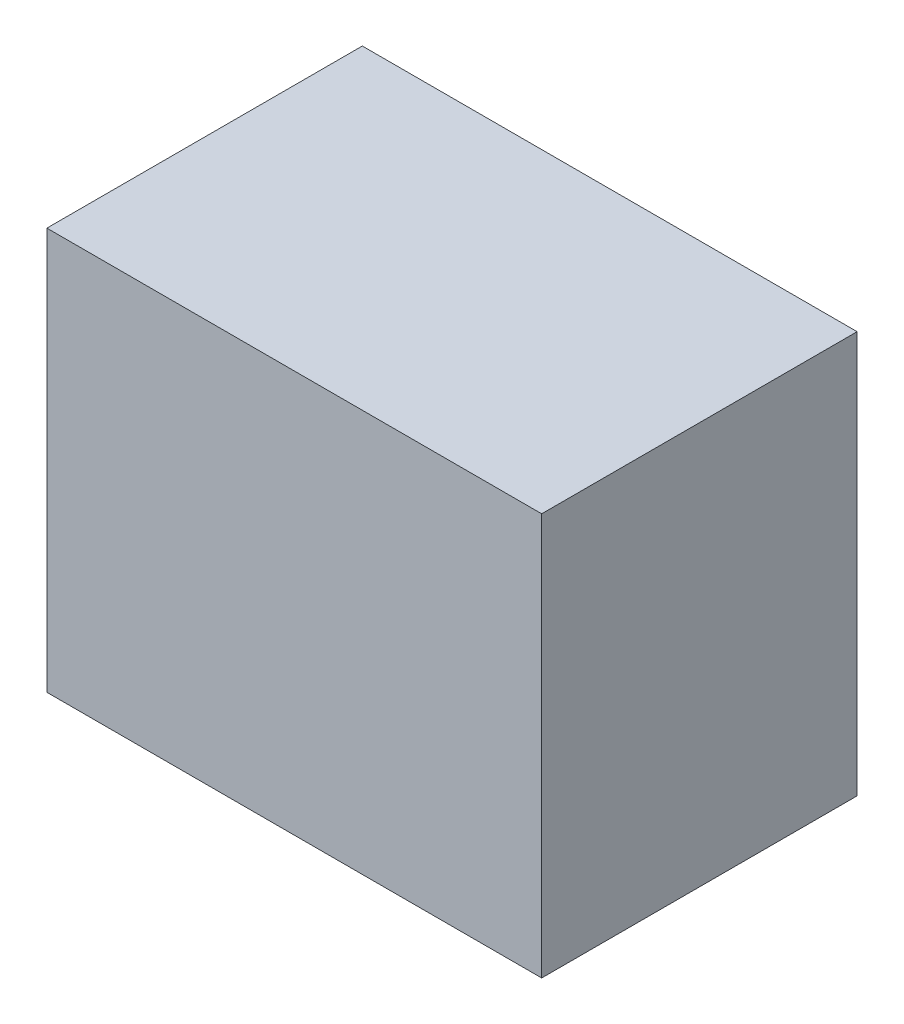
ISO-10303-21;
HEADER;
FILE_DESCRIPTION(('STEP AP214'),'2;1');
FILE_NAME('part.step','',(''),(''),'','','');
FILE_SCHEMA(('AUTOMOTIVE_DESIGN { 1 0 10303 214 1 1 1 1 }'));
ENDSEC;
DATA;
#1=APPLICATION_CONTEXT('core data for automotive mechanical design processes');
#2=APPLICATION_PROTOCOL_DEFINITION('international standard','automotive_design',2000,#1);
#3=PRODUCT_CONTEXT('',#1,'mechanical');
#4=PRODUCT('Part','Part','',(#3));
#5=PRODUCT_RELATED_PRODUCT_CATEGORY('part','',(#4));
#6=PRODUCT_DEFINITION_FORMATION('','',#4);
#7=PRODUCT_DEFINITION_CONTEXT('part definition',#1,'design');
#8=PRODUCT_DEFINITION('design','',#6,#7);
#9=PRODUCT_DEFINITION_SHAPE('','',#8);
#10=(LENGTH_UNIT() NAMED_UNIT(*) SI_UNIT(.MILLI.,.METRE.));
#11=(NAMED_UNIT(*) PLANE_ANGLE_UNIT() SI_UNIT($,.RADIAN.));
#12=(NAMED_UNIT(*) SI_UNIT($,.STERADIAN.) SOLID_ANGLE_UNIT());
#13=UNCERTAINTY_MEASURE_WITH_UNIT(LENGTH_MEASURE(1.E-05),#10,'distance_accuracy_value','');
#14=(GEOMETRIC_REPRESENTATION_CONTEXT(3) GLOBAL_UNCERTAINTY_ASSIGNED_CONTEXT((#13)) GLOBAL_UNIT_ASSIGNED_CONTEXT((#10,
#11,#12)) REPRESENTATION_CONTEXT('',''));
#15=CARTESIAN_POINT('',(0.,0.,0.));
#16=DIRECTION('',(0.,0.,1.));
#17=DIRECTION('',(1.,0.,0.));
#18=AXIS2_PLACEMENT_3D('',#15,#16,#17);
#19=CARTESIAN_POINT('',(-80.,-65.,102.));
#20=DIRECTION('',(1.,0.,0.));
#21=DIRECTION('',(0.,0.,-1.));
#22=AXIS2_PLACEMENT_3D('',#19,#20,#21);
#23=PLANE('',#22);
#24=DIRECTION('',(0.,-1.,0.));
#25=VECTOR('',#24,1.);
#26=CARTESIAN_POINT('',(-80.,-65.,0.));
#27=LINE('',#26,#25);
#28=CARTESIAN_POINT('',(-80.,65.,0.));
#29=VERTEX_POINT('',#28);
#30=CARTESIAN_POINT('',(-80.,-65.,0.));
#31=VERTEX_POINT('',#30);
#32=EDGE_CURVE('E107',#29,#31,#27,.T.);
#33=ORIENTED_EDGE('',*,*,#32,.T.);
#34=DIRECTION('',(0.,0.,-1.));
#35=VECTOR('',#34,1.);
#36=CARTESIAN_POINT('',(-80.,-65.,102.));
#37=LINE('',#36,#35);
#38=CARTESIAN_POINT('',(-80.,-65.,102.));
#39=VERTEX_POINT('',#38);
#40=EDGE_CURVE('E11',#39,#31,#37,.T.);
#41=ORIENTED_EDGE('',*,*,#40,.F.);
#42=DIRECTION('',(0.,-1.,0.));
#43=VECTOR('',#42,1.);
#44=CARTESIAN_POINT('',(-80.,-65.,102.));
#45=LINE('',#44,#43);
#46=CARTESIAN_POINT('',(-80.,65.,102.));
#47=VERTEX_POINT('',#46);
#48=EDGE_CURVE('E91',#47,#39,#45,.T.);
#49=ORIENTED_EDGE('',*,*,#48,.F.);
#50=DIRECTION('',(0.,0.,-1.));
#51=VECTOR('',#50,1.);
#52=CARTESIAN_POINT('',(-80.,65.,102.));
#53=LINE('',#52,#51);
#54=EDGE_CURVE('E103',#47,#29,#53,.T.);
#55=ORIENTED_EDGE('',*,*,#54,.T.);
#56=EDGE_LOOP('',(#33,#41,#49,#55));
#57=FACE_BOUND('',#56,.T.);
#58=ADVANCED_FACE('F39',(#57),#23,.F.);
#59=CARTESIAN_POINT('',(80.,-65.,102.));
#60=DIRECTION('',(0.,1.,0.));
#61=DIRECTION('',(-1.,0.,0.));
#62=AXIS2_PLACEMENT_3D('',#59,#60,#61);
#63=PLANE('',#62);
#64=DIRECTION('',(1.,0.,0.));
#65=VECTOR('',#64,1.);
#66=CARTESIAN_POINT('',(80.,-65.,0.));
#67=LINE('',#66,#65);
#68=CARTESIAN_POINT('',(80.,-65.,0.));
#69=VERTEX_POINT('',#68);
#70=EDGE_CURVE('E96',#31,#69,#67,.T.);
#71=ORIENTED_EDGE('',*,*,#70,.T.);
#72=DIRECTION('',(0.,0.,-1.));
#73=VECTOR('',#72,1.);
#74=CARTESIAN_POINT('',(80.,-65.,102.));
#75=LINE('',#74,#73);
#76=CARTESIAN_POINT('',(80.,-65.,102.));
#77=VERTEX_POINT('',#76);
#78=EDGE_CURVE('E48',#77,#69,#75,.T.);
#79=ORIENTED_EDGE('',*,*,#78,.F.);
#80=DIRECTION('',(1.,0.,0.));
#81=VECTOR('',#80,1.);
#82=CARTESIAN_POINT('',(80.,-65.,102.));
#83=LINE('',#82,#81);
#84=EDGE_CURVE('E86',#39,#77,#83,.T.);
#85=ORIENTED_EDGE('',*,*,#84,.F.);
#86=ORIENTED_EDGE('',*,*,#40,.T.);
#87=EDGE_LOOP('',(#71,#79,#85,#86));
#88=FACE_BOUND('',#87,.T.);
#89=ADVANCED_FACE('F95',(#88),#63,.F.);
#90=CARTESIAN_POINT('',(80.,-65.,102.));
#91=DIRECTION('',(-1.,0.,0.));
#92=DIRECTION('',(0.,0.,1.));
#93=AXIS2_PLACEMENT_3D('',#90,#91,#92);
#94=PLANE('',#93);
#95=DIRECTION('',(0.,1.,0.));
#96=VECTOR('',#95,1.);
#97=CARTESIAN_POINT('',(80.,-65.,0.));
#98=LINE('',#97,#96);
#99=CARTESIAN_POINT('',(80.,65.,0.));
#100=VERTEX_POINT('',#99);
#101=EDGE_CURVE('E73',#69,#100,#98,.T.);
#102=ORIENTED_EDGE('',*,*,#101,.T.);
#103=DIRECTION('',(0.,0.,-1.));
#104=VECTOR('',#103,1.);
#105=CARTESIAN_POINT('',(80.,65.,102.));
#106=LINE('',#105,#104);
#107=CARTESIAN_POINT('',(80.,65.,102.));
#108=VERTEX_POINT('',#107);
#109=EDGE_CURVE('E98',#108,#100,#106,.T.);
#110=ORIENTED_EDGE('',*,*,#109,.F.);
#111=DIRECTION('',(0.,1.,0.));
#112=VECTOR('',#111,1.);
#113=CARTESIAN_POINT('',(80.,-65.,102.));
#114=LINE('',#113,#112);
#115=EDGE_CURVE('E89',#77,#108,#114,.T.);
#116=ORIENTED_EDGE('',*,*,#115,.F.);
#117=ORIENTED_EDGE('',*,*,#78,.T.);
#118=EDGE_LOOP('',(#102,#110,#116,#117));
#119=FACE_BOUND('',#118,.T.);
#120=ADVANCED_FACE('F99',(#119),#94,.F.);
#121=CARTESIAN_POINT('',(80.,65.,102.));
#122=DIRECTION('',(0.,-1.,0.));
#123=DIRECTION('',(1.,0.,0.));
#124=AXIS2_PLACEMENT_3D('',#121,#122,#123);
#125=PLANE('',#124);
#126=DIRECTION('',(-1.,0.,0.));
#127=VECTOR('',#126,1.);
#128=CARTESIAN_POINT('',(80.,65.,0.));
#129=LINE('',#128,#127);
#130=EDGE_CURVE('E79',#100,#29,#129,.T.);
#131=ORIENTED_EDGE('',*,*,#130,.T.);
#132=ORIENTED_EDGE('',*,*,#54,.F.);
#133=DIRECTION('',(-1.,0.,0.));
#134=VECTOR('',#133,1.);
#135=CARTESIAN_POINT('',(80.,65.,102.));
#136=LINE('',#135,#134);
#137=EDGE_CURVE('E56',#108,#47,#136,.T.);
#138=ORIENTED_EDGE('',*,*,#137,.F.);
#139=ORIENTED_EDGE('',*,*,#109,.T.);
#140=EDGE_LOOP('',(#131,#132,#138,#139));
#141=FACE_BOUND('',#140,.T.);
#142=ADVANCED_FACE('F120',(#141),#125,.F.);
#143=CARTESIAN_POINT('',(0.,0.,102.));
#144=DIRECTION('',(0.,0.,1.));
#145=DIRECTION('',(1.,0.,0.));
#146=AXIS2_PLACEMENT_3D('',#143,#144,#145);
#147=PLANE('',#146);
#148=ORIENTED_EDGE('',*,*,#48,.T.);
#149=ORIENTED_EDGE('',*,*,#84,.T.);
#150=ORIENTED_EDGE('',*,*,#115,.T.);
#151=ORIENTED_EDGE('',*,*,#137,.T.);
#152=EDGE_LOOP('',(#148,#149,#150,#151));
#153=FACE_BOUND('',#152,.T.);
#154=ADVANCED_FACE('F87',(#153),#147,.T.);
#155=CARTESIAN_POINT('',(0.,0.,0.));
#156=DIRECTION('',(0.,0.,1.));
#157=DIRECTION('',(1.,0.,0.));
#158=AXIS2_PLACEMENT_3D('',#155,#156,#157);
#159=PLANE('',#158);
#160=ORIENTED_EDGE('',*,*,#32,.F.);
#161=ORIENTED_EDGE('',*,*,#130,.F.);
#162=ORIENTED_EDGE('',*,*,#101,.F.);
#163=ORIENTED_EDGE('',*,*,#70,.F.);
#164=EDGE_LOOP('',(#160,#161,#162,#163));
#165=FACE_BOUND('',#164,.T.);
#166=ADVANCED_FACE('F123',(#165),#159,.F.);
#167=CLOSED_SHELL('',(#58,#89,#120,#142,#154,#166));
#168=MANIFOLD_SOLID_BREP('B2',#167);
#169=ADVANCED_BREP_SHAPE_REPRESENTATION('',(#18,#168),#14);
#170=SHAPE_DEFINITION_REPRESENTATION(#9,#169);
ENDSEC;
END-ISO-10303-21;
